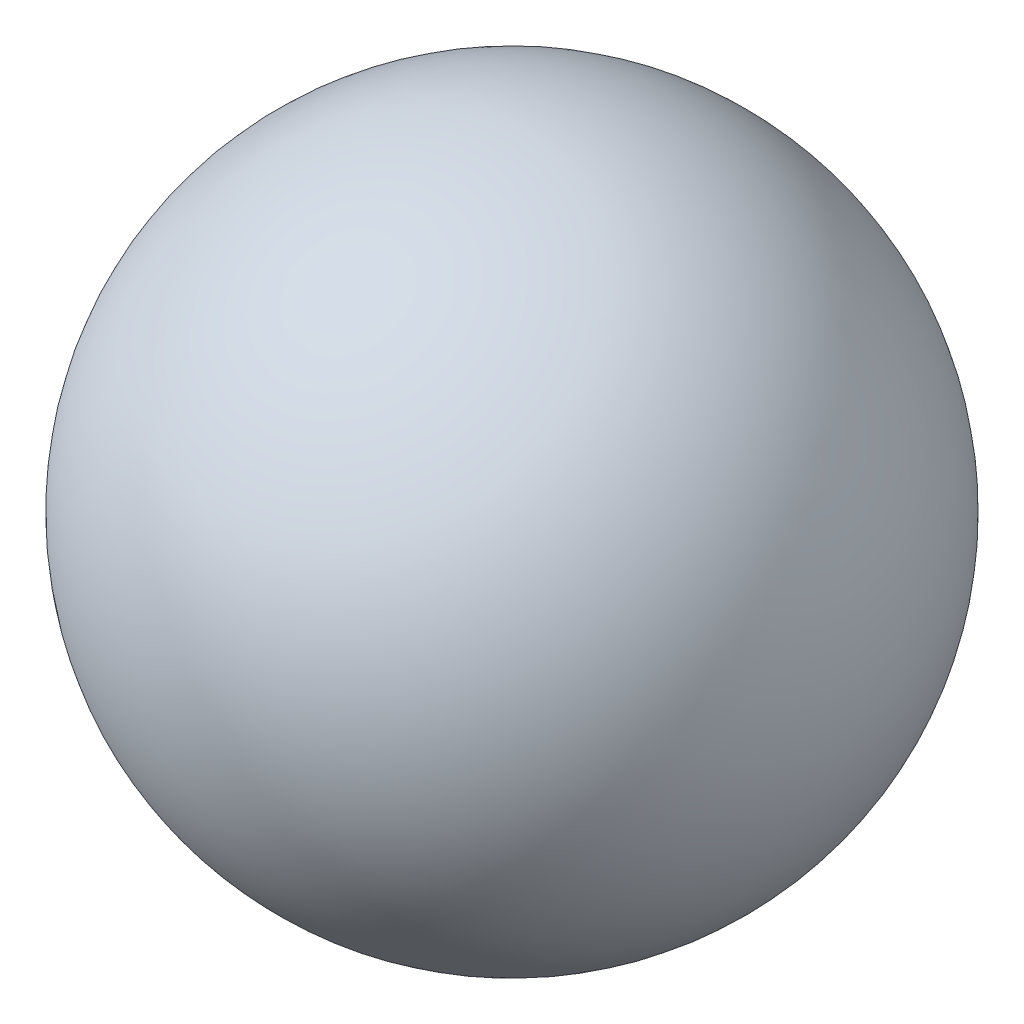
ISO-10303-21;
HEADER;
FILE_DESCRIPTION(('STEP AP214'),'2;1');
FILE_NAME('part.step','',(''),(''),'','','');
FILE_SCHEMA(('AUTOMOTIVE_DESIGN { 1 0 10303 214 1 1 1 1 }'));
ENDSEC;
DATA;
#1=APPLICATION_CONTEXT('core data for automotive mechanical design processes');
#2=APPLICATION_PROTOCOL_DEFINITION('international standard','automotive_design',2000,#1);
#3=PRODUCT_CONTEXT('',#1,'mechanical');
#4=PRODUCT('Part','Part','',(#3));
#5=PRODUCT_RELATED_PRODUCT_CATEGORY('part','',(#4));
#6=PRODUCT_DEFINITION_FORMATION('','',#4);
#7=PRODUCT_DEFINITION_CONTEXT('part definition',#1,'design');
#8=PRODUCT_DEFINITION('design','',#6,#7);
#9=PRODUCT_DEFINITION_SHAPE('','',#8);
#10=(LENGTH_UNIT() NAMED_UNIT(*) SI_UNIT(.MILLI.,.METRE.));
#11=(NAMED_UNIT(*) PLANE_ANGLE_UNIT() SI_UNIT($,.RADIAN.));
#12=(NAMED_UNIT(*) SI_UNIT($,.STERADIAN.) SOLID_ANGLE_UNIT());
#13=UNCERTAINTY_MEASURE_WITH_UNIT(LENGTH_MEASURE(1.E-05),#10,'distance_accuracy_value','');
#14=(GEOMETRIC_REPRESENTATION_CONTEXT(3) GLOBAL_UNCERTAINTY_ASSIGNED_CONTEXT((#13)) GLOBAL_UNIT_ASSIGNED_CONTEXT((#10,
#11,#12)) REPRESENTATION_CONTEXT('',''));
#15=CARTESIAN_POINT('',(0.,0.,0.));
#16=DIRECTION('',(0.,0.,1.));
#17=DIRECTION('',(1.,0.,0.));
#18=AXIS2_PLACEMENT_3D('',#15,#16,#17);
#19=CARTESIAN_POINT('',(0.,0.,0.));
#20=DIRECTION('',(0.554606430632221,0.83056171441198,0.0507833206320791));
#21=DIRECTION('',(-0.441643280868712,0.242084128459392,0.863913472062785));
#22=AXIS2_PLACEMENT_3D('',#19,#20,#21);
#23=SPHERICAL_SURFACE('',#22,1.1905);
#24=CARTESIAN_POINT('',(0.660258955667659,0.988783721007461,0.0604575432124901));
#25=VERTEX_POINT('',#24);
#26=VERTEX_LOOP('',#25);
#27=FACE_BOUND('',#26,.T.);
#28=CARTESIAN_POINT('',(-0.66025895566766,-0.988783721007462,-0.06045754321249));
#29=VERTEX_POINT('',#28);
#30=VERTEX_LOOP('',#29);
#31=FACE_BOUND('',#30,.T.);
#32=ADVANCED_FACE('F15',(#27,#31),#23,.T.);
#33=CLOSED_SHELL('',(#32));
#34=MANIFOLD_SOLID_BREP('B1',#33);
#35=ADVANCED_BREP_SHAPE_REPRESENTATION('',(#18,#34),#14);
#36=SHAPE_DEFINITION_REPRESENTATION(#9,#35);
ENDSEC;
END-ISO-10303-21;
